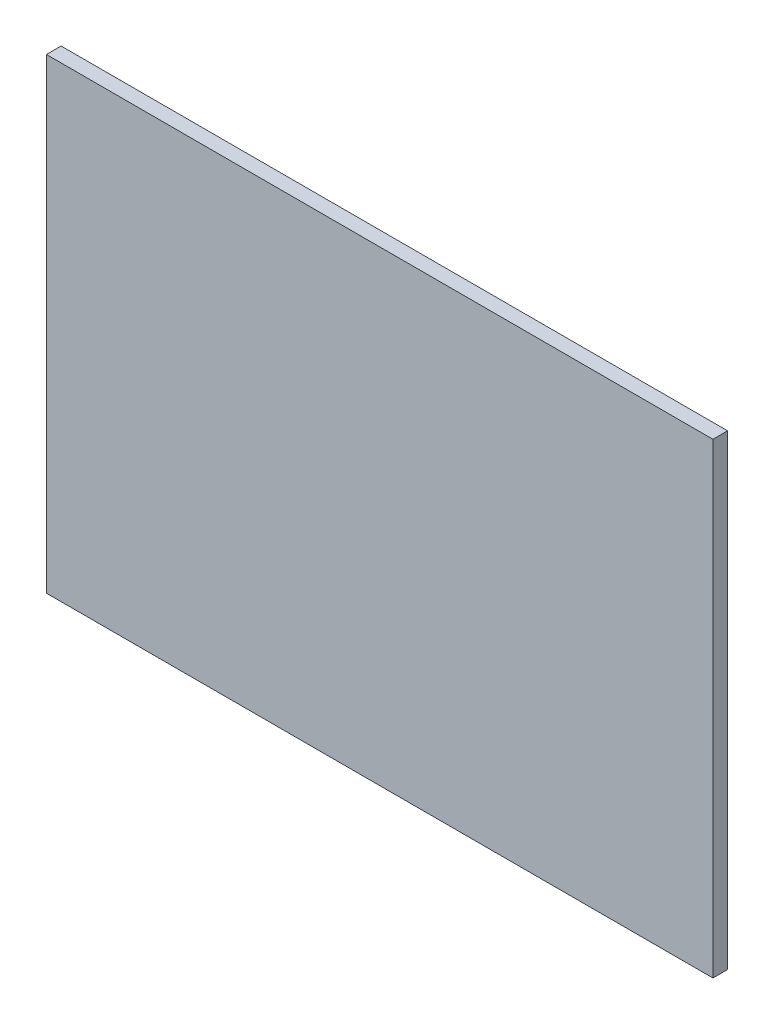
ISO-10303-21;
HEADER;
FILE_DESCRIPTION(('STEP AP214'),'2;1');
FILE_NAME('part.step','',(''),(''),'','','');
FILE_SCHEMA(('AUTOMOTIVE_DESIGN { 1 0 10303 214 1 1 1 1 }'));
ENDSEC;
DATA;
#1=APPLICATION_CONTEXT('core data for automotive mechanical design processes');
#2=APPLICATION_PROTOCOL_DEFINITION('international standard','automotive_design',2000,#1);
#3=PRODUCT_CONTEXT('',#1,'mechanical');
#4=PRODUCT('Part','Part','',(#3));
#5=PRODUCT_RELATED_PRODUCT_CATEGORY('part','',(#4));
#6=PRODUCT_DEFINITION_FORMATION('','',#4);
#7=PRODUCT_DEFINITION_CONTEXT('part definition',#1,'design');
#8=PRODUCT_DEFINITION('design','',#6,#7);
#9=PRODUCT_DEFINITION_SHAPE('','',#8);
#10=(LENGTH_UNIT() NAMED_UNIT(*) SI_UNIT(.MILLI.,.METRE.));
#11=(NAMED_UNIT(*) PLANE_ANGLE_UNIT() SI_UNIT($,.RADIAN.));
#12=(NAMED_UNIT(*) SI_UNIT($,.STERADIAN.) SOLID_ANGLE_UNIT());
#13=UNCERTAINTY_MEASURE_WITH_UNIT(LENGTH_MEASURE(1.E-05),#10,'distance_accuracy_value','');
#14=(GEOMETRIC_REPRESENTATION_CONTEXT(3) GLOBAL_UNCERTAINTY_ASSIGNED_CONTEXT((#13)) GLOBAL_UNIT_ASSIGNED_CONTEXT((#10,
#11,#12)) REPRESENTATION_CONTEXT('',''));
#15=CARTESIAN_POINT('',(0.,0.,0.));
#16=DIRECTION('',(0.,0.,1.));
#17=DIRECTION('',(1.,0.,0.));
#18=AXIS2_PLACEMENT_3D('',#15,#16,#17);
#19=CARTESIAN_POINT('',(25.,-17.5,1.1));
#20=DIRECTION('',(-1.,0.,0.));
#21=DIRECTION('',(0.,0.,1.));
#22=AXIS2_PLACEMENT_3D('',#19,#20,#21);
#23=PLANE('',#22);
#24=DIRECTION('',(0.,1.,0.));
#25=VECTOR('',#24,1.);
#26=CARTESIAN_POINT('',(25.,-17.5,0.));
#27=LINE('',#26,#25);
#28=CARTESIAN_POINT('',(25.,-17.5,0.));
#29=VERTEX_POINT('',#28);
#30=CARTESIAN_POINT('',(25.,17.5,0.));
#31=VERTEX_POINT('',#30);
#32=EDGE_CURVE('E96',#29,#31,#27,.T.);
#33=ORIENTED_EDGE('',*,*,#32,.T.);
#34=DIRECTION('',(0.,0.,-1.));
#35=VECTOR('',#34,1.);
#36=CARTESIAN_POINT('',(25.,17.5,1.1));
#37=LINE('',#36,#35);
#38=CARTESIAN_POINT('',(25.,17.5,1.1));
#39=VERTEX_POINT('',#38);
#40=EDGE_CURVE('E11',#39,#31,#37,.T.);
#41=ORIENTED_EDGE('',*,*,#40,.F.);
#42=DIRECTION('',(0.,1.,0.));
#43=VECTOR('',#42,1.);
#44=CARTESIAN_POINT('',(25.,-17.5,1.1));
#45=LINE('',#44,#43);
#46=CARTESIAN_POINT('',(25.,-17.5,1.1));
#47=VERTEX_POINT('',#46);
#48=EDGE_CURVE('E84',#47,#39,#45,.T.);
#49=ORIENTED_EDGE('',*,*,#48,.F.);
#50=DIRECTION('',(0.,0.,-1.));
#51=VECTOR('',#50,1.);
#52=CARTESIAN_POINT('',(25.,-17.5,1.1));
#53=LINE('',#52,#51);
#54=EDGE_CURVE('E92',#47,#29,#53,.T.);
#55=ORIENTED_EDGE('',*,*,#54,.T.);
#56=EDGE_LOOP('',(#33,#41,#49,#55));
#57=FACE_BOUND('',#56,.T.);
#58=ADVANCED_FACE('F33',(#57),#23,.F.);
#59=CARTESIAN_POINT('',(-25.,17.5,1.1));
#60=DIRECTION('',(0.,-1.,0.));
#61=DIRECTION('',(0.,0.,-1.));
#62=AXIS2_PLACEMENT_3D('',#59,#60,#61);
#63=PLANE('',#62);
#64=DIRECTION('',(-1.,0.,0.));
#65=VECTOR('',#64,1.);
#66=CARTESIAN_POINT('',(-25.,17.5,0.));
#67=LINE('',#66,#65);
#68=CARTESIAN_POINT('',(-25.,17.5,0.));
#69=VERTEX_POINT('',#68);
#70=EDGE_CURVE('E88',#31,#69,#67,.T.);
#71=ORIENTED_EDGE('',*,*,#70,.T.);
#72=DIRECTION('',(0.,0.,-1.));
#73=VECTOR('',#72,1.);
#74=CARTESIAN_POINT('',(-25.,17.5,1.1));
#75=LINE('',#74,#73);
#76=CARTESIAN_POINT('',(-25.,17.5,1.1));
#77=VERTEX_POINT('',#76);
#78=EDGE_CURVE('E41',#77,#69,#75,.T.);
#79=ORIENTED_EDGE('',*,*,#78,.F.);
#80=DIRECTION('',(-1.,0.,0.));
#81=VECTOR('',#80,1.);
#82=CARTESIAN_POINT('',(-25.,17.5,1.1));
#83=LINE('',#82,#81);
#84=EDGE_CURVE('E79',#39,#77,#83,.T.);
#85=ORIENTED_EDGE('',*,*,#84,.F.);
#86=ORIENTED_EDGE('',*,*,#40,.T.);
#87=EDGE_LOOP('',(#71,#79,#85,#86));
#88=FACE_BOUND('',#87,.T.);
#89=ADVANCED_FACE('F87',(#88),#63,.F.);
#90=CARTESIAN_POINT('',(-25.,-17.5,1.1));
#91=DIRECTION('',(1.,0.,0.));
#92=DIRECTION('',(0.,0.,-1.));
#93=AXIS2_PLACEMENT_3D('',#90,#91,#92);
#94=PLANE('',#93);
#95=DIRECTION('',(0.,-1.,0.));
#96=VECTOR('',#95,1.);
#97=CARTESIAN_POINT('',(-25.,-17.5,0.));
#98=LINE('',#97,#96);
#99=CARTESIAN_POINT('',(-25.,-17.5,0.));
#100=VERTEX_POINT('',#99);
#101=EDGE_CURVE('E66',#69,#100,#98,.T.);
#102=ORIENTED_EDGE('',*,*,#101,.T.);
#103=DIRECTION('',(0.,0.,-1.));
#104=VECTOR('',#103,1.);
#105=CARTESIAN_POINT('',(-25.,-17.5,1.1));
#106=LINE('',#105,#104);
#107=CARTESIAN_POINT('',(-25.,-17.5,1.1));
#108=VERTEX_POINT('',#107);
#109=EDGE_CURVE('E89',#108,#100,#106,.T.);
#110=ORIENTED_EDGE('',*,*,#109,.F.);
#111=DIRECTION('',(0.,-1.,0.));
#112=VECTOR('',#111,1.);
#113=CARTESIAN_POINT('',(-25.,-17.5,1.1));
#114=LINE('',#113,#112);
#115=EDGE_CURVE('E82',#77,#108,#114,.T.);
#116=ORIENTED_EDGE('',*,*,#115,.F.);
#117=ORIENTED_EDGE('',*,*,#78,.T.);
#118=EDGE_LOOP('',(#102,#110,#116,#117));
#119=FACE_BOUND('',#118,.T.);
#120=ADVANCED_FACE('F90',(#119),#94,.F.);
#121=CARTESIAN_POINT('',(-25.,-17.5,1.1));
#122=DIRECTION('',(0.,1.,0.));
#123=DIRECTION('',(0.,0.,1.));
#124=AXIS2_PLACEMENT_3D('',#121,#122,#123);
#125=PLANE('',#124);
#126=DIRECTION('',(1.,0.,0.));
#127=VECTOR('',#126,1.);
#128=CARTESIAN_POINT('',(-25.,-17.5,0.));
#129=LINE('',#128,#127);
#130=EDGE_CURVE('E72',#100,#29,#129,.T.);
#131=ORIENTED_EDGE('',*,*,#130,.T.);
#132=ORIENTED_EDGE('',*,*,#54,.F.);
#133=DIRECTION('',(1.,0.,0.));
#134=VECTOR('',#133,1.);
#135=CARTESIAN_POINT('',(-25.,-17.5,1.1));
#136=LINE('',#135,#134);
#137=EDGE_CURVE('E49',#108,#47,#136,.T.);
#138=ORIENTED_EDGE('',*,*,#137,.F.);
#139=ORIENTED_EDGE('',*,*,#109,.T.);
#140=EDGE_LOOP('',(#131,#132,#138,#139));
#141=FACE_BOUND('',#140,.T.);
#142=ADVANCED_FACE('F103',(#141),#125,.F.);
#143=CARTESIAN_POINT('',(0.,0.,1.1));
#144=DIRECTION('',(0.,0.,-1.));
#145=DIRECTION('',(-1.,0.,0.));
#146=AXIS2_PLACEMENT_3D('',#143,#144,#145);
#147=PLANE('',#146);
#148=ORIENTED_EDGE('',*,*,#48,.T.);
#149=ORIENTED_EDGE('',*,*,#84,.T.);
#150=ORIENTED_EDGE('',*,*,#115,.T.);
#151=ORIENTED_EDGE('',*,*,#137,.T.);
#152=EDGE_LOOP('',(#148,#149,#150,#151));
#153=FACE_BOUND('',#152,.T.);
#154=ADVANCED_FACE('F80',(#153),#147,.F.);
#155=CARTESIAN_POINT('',(0.,0.,0.));
#156=DIRECTION('',(0.,0.,-1.));
#157=DIRECTION('',(-1.,0.,0.));
#158=AXIS2_PLACEMENT_3D('',#155,#156,#157);
#159=PLANE('',#158);
#160=ORIENTED_EDGE('',*,*,#32,.F.);
#161=ORIENTED_EDGE('',*,*,#130,.F.);
#162=ORIENTED_EDGE('',*,*,#101,.F.);
#163=ORIENTED_EDGE('',*,*,#70,.F.);
#164=EDGE_LOOP('',(#160,#161,#162,#163));
#165=FACE_BOUND('',#164,.T.);
#166=ADVANCED_FACE('F106',(#165),#159,.T.);
#167=CLOSED_SHELL('',(#58,#89,#120,#142,#154,#166));
#168=MANIFOLD_SOLID_BREP('B2',#167);
#169=ADVANCED_BREP_SHAPE_REPRESENTATION('',(#18,#168),#14);
#170=SHAPE_DEFINITION_REPRESENTATION(#9,#169);
ENDSEC;
END-ISO-10303-21;
